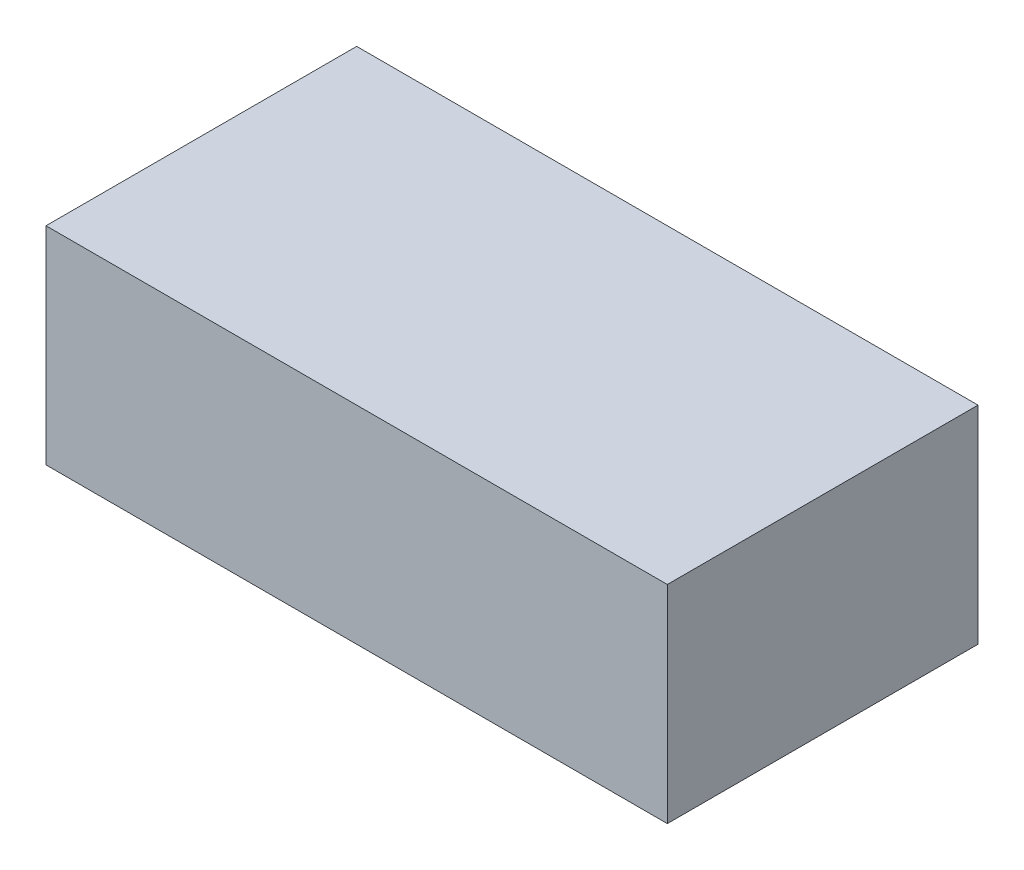
ISO-10303-21;
HEADER;
FILE_DESCRIPTION(('STEP AP214'),'2;1');
FILE_NAME('part.step','',(''),(''),'','','');
FILE_SCHEMA(('AUTOMOTIVE_DESIGN { 1 0 10303 214 1 1 1 1 }'));
ENDSEC;
DATA;
#1=APPLICATION_CONTEXT('core data for automotive mechanical design processes');
#2=APPLICATION_PROTOCOL_DEFINITION('international standard','automotive_design',2000,#1);
#3=PRODUCT_CONTEXT('',#1,'mechanical');
#4=PRODUCT('Part','Part','',(#3));
#5=PRODUCT_RELATED_PRODUCT_CATEGORY('part','',(#4));
#6=PRODUCT_DEFINITION_FORMATION('','',#4);
#7=PRODUCT_DEFINITION_CONTEXT('part definition',#1,'design');
#8=PRODUCT_DEFINITION('design','',#6,#7);
#9=PRODUCT_DEFINITION_SHAPE('','',#8);
#10=(LENGTH_UNIT() NAMED_UNIT(*) SI_UNIT(.MILLI.,.METRE.));
#11=(NAMED_UNIT(*) PLANE_ANGLE_UNIT() SI_UNIT($,.RADIAN.));
#12=(NAMED_UNIT(*) SI_UNIT($,.STERADIAN.) SOLID_ANGLE_UNIT());
#13=UNCERTAINTY_MEASURE_WITH_UNIT(LENGTH_MEASURE(1.E-05),#10,'distance_accuracy_value','');
#14=(GEOMETRIC_REPRESENTATION_CONTEXT(3) GLOBAL_UNCERTAINTY_ASSIGNED_CONTEXT((#13)) GLOBAL_UNIT_ASSIGNED_CONTEXT((#10,
#11,#12)) REPRESENTATION_CONTEXT('',''));
#15=CARTESIAN_POINT('',(0.,0.,0.));
#16=DIRECTION('',(0.,0.,1.));
#17=DIRECTION('',(1.,0.,0.));
#18=AXIS2_PLACEMENT_3D('',#15,#16,#17);
#19=CARTESIAN_POINT('',(30.,20.,15.));
#20=DIRECTION('',(-1.,0.,0.));
#21=DIRECTION('',(0.,0.,1.));
#22=AXIS2_PLACEMENT_3D('',#19,#20,#21);
#23=PLANE('',#22);
#24=DIRECTION('',(0.,0.,-1.));
#25=VECTOR('',#24,1.);
#26=CARTESIAN_POINT('',(30.,0.,15.));
#27=LINE('',#26,#25);
#28=CARTESIAN_POINT('',(30.,0.,15.));
#29=VERTEX_POINT('',#28);
#30=CARTESIAN_POINT('',(30.,0.,-15.0000000000001));
#31=VERTEX_POINT('',#30);
#32=EDGE_CURVE('E96',#29,#31,#27,.T.);
#33=ORIENTED_EDGE('',*,*,#32,.T.);
#34=DIRECTION('',(0.,-1.,0.));
#35=VECTOR('',#34,1.);
#36=CARTESIAN_POINT('',(30.,20.,-15.0000000000001));
#37=LINE('',#36,#35);
#38=CARTESIAN_POINT('',(30.,20.,-15.0000000000001));
#39=VERTEX_POINT('',#38);
#40=EDGE_CURVE('E11',#39,#31,#37,.T.);
#41=ORIENTED_EDGE('',*,*,#40,.F.);
#42=DIRECTION('',(0.,0.,-1.));
#43=VECTOR('',#42,1.);
#44=CARTESIAN_POINT('',(30.,20.,15.));
#45=LINE('',#44,#43);
#46=CARTESIAN_POINT('',(30.,20.,15.));
#47=VERTEX_POINT('',#46);
#48=EDGE_CURVE('E84',#47,#39,#45,.T.);
#49=ORIENTED_EDGE('',*,*,#48,.F.);
#50=DIRECTION('',(0.,-1.,0.));
#51=VECTOR('',#50,1.);
#52=CARTESIAN_POINT('',(30.,20.,15.));
#53=LINE('',#52,#51);
#54=EDGE_CURVE('E92',#47,#29,#53,.T.);
#55=ORIENTED_EDGE('',*,*,#54,.T.);
#56=EDGE_LOOP('',(#33,#41,#49,#55));
#57=FACE_BOUND('',#56,.T.);
#58=ADVANCED_FACE('F33',(#57),#23,.F.);
#59=CARTESIAN_POINT('',(-30.,20.,-15.0000000000001));
#60=DIRECTION('',(0.,0.,1.));
#61=DIRECTION('',(1.,0.,0.));
#62=AXIS2_PLACEMENT_3D('',#59,#60,#61);
#63=PLANE('',#62);
#64=DIRECTION('',(-1.,0.,0.));
#65=VECTOR('',#64,1.);
#66=CARTESIAN_POINT('',(-30.,0.,-15.0000000000001));
#67=LINE('',#66,#65);
#68=CARTESIAN_POINT('',(-30.,0.,-15.0000000000001));
#69=VERTEX_POINT('',#68);
#70=EDGE_CURVE('E88',#31,#69,#67,.T.);
#71=ORIENTED_EDGE('',*,*,#70,.T.);
#72=DIRECTION('',(0.,-1.,0.));
#73=VECTOR('',#72,1.);
#74=CARTESIAN_POINT('',(-30.,20.,-15.0000000000001));
#75=LINE('',#74,#73);
#76=CARTESIAN_POINT('',(-30.,20.,-15.0000000000001));
#77=VERTEX_POINT('',#76);
#78=EDGE_CURVE('E41',#77,#69,#75,.T.);
#79=ORIENTED_EDGE('',*,*,#78,.F.);
#80=DIRECTION('',(-1.,0.,0.));
#81=VECTOR('',#80,1.);
#82=CARTESIAN_POINT('',(-30.,20.,-15.0000000000001));
#83=LINE('',#82,#81);
#84=EDGE_CURVE('E79',#39,#77,#83,.T.);
#85=ORIENTED_EDGE('',*,*,#84,.F.);
#86=ORIENTED_EDGE('',*,*,#40,.T.);
#87=EDGE_LOOP('',(#71,#79,#85,#86));
#88=FACE_BOUND('',#87,.T.);
#89=ADVANCED_FACE('F87',(#88),#63,.F.);
#90=CARTESIAN_POINT('',(-30.,20.,15.));
#91=DIRECTION('',(1.,0.,0.));
#92=DIRECTION('',(0.,0.,-1.));
#93=AXIS2_PLACEMENT_3D('',#90,#91,#92);
#94=PLANE('',#93);
#95=DIRECTION('',(0.,0.,1.));
#96=VECTOR('',#95,1.);
#97=CARTESIAN_POINT('',(-30.,0.,15.));
#98=LINE('',#97,#96);
#99=CARTESIAN_POINT('',(-30.,0.,15.));
#100=VERTEX_POINT('',#99);
#101=EDGE_CURVE('E66',#69,#100,#98,.T.);
#102=ORIENTED_EDGE('',*,*,#101,.T.);
#103=DIRECTION('',(0.,-1.,0.));
#104=VECTOR('',#103,1.);
#105=CARTESIAN_POINT('',(-30.,20.,15.));
#106=LINE('',#105,#104);
#107=CARTESIAN_POINT('',(-30.,20.,15.));
#108=VERTEX_POINT('',#107);
#109=EDGE_CURVE('E89',#108,#100,#106,.T.);
#110=ORIENTED_EDGE('',*,*,#109,.F.);
#111=DIRECTION('',(0.,0.,1.));
#112=VECTOR('',#111,1.);
#113=CARTESIAN_POINT('',(-30.,20.,15.));
#114=LINE('',#113,#112);
#115=EDGE_CURVE('E82',#77,#108,#114,.T.);
#116=ORIENTED_EDGE('',*,*,#115,.F.);
#117=ORIENTED_EDGE('',*,*,#78,.T.);
#118=EDGE_LOOP('',(#102,#110,#116,#117));
#119=FACE_BOUND('',#118,.T.);
#120=ADVANCED_FACE('F90',(#119),#94,.F.);
#121=CARTESIAN_POINT('',(-30.,20.,15.));
#122=DIRECTION('',(0.,0.,-1.));
#123=DIRECTION('',(-1.,0.,0.));
#124=AXIS2_PLACEMENT_3D('',#121,#122,#123);
#125=PLANE('',#124);
#126=DIRECTION('',(1.,0.,0.));
#127=VECTOR('',#126,1.);
#128=CARTESIAN_POINT('',(-30.,0.,15.));
#129=LINE('',#128,#127);
#130=EDGE_CURVE('E72',#100,#29,#129,.T.);
#131=ORIENTED_EDGE('',*,*,#130,.T.);
#132=ORIENTED_EDGE('',*,*,#54,.F.);
#133=DIRECTION('',(1.,0.,0.));
#134=VECTOR('',#133,1.);
#135=CARTESIAN_POINT('',(-30.,20.,15.));
#136=LINE('',#135,#134);
#137=EDGE_CURVE('E49',#108,#47,#136,.T.);
#138=ORIENTED_EDGE('',*,*,#137,.F.);
#139=ORIENTED_EDGE('',*,*,#109,.T.);
#140=EDGE_LOOP('',(#131,#132,#138,#139));
#141=FACE_BOUND('',#140,.T.);
#142=ADVANCED_FACE('F103',(#141),#125,.F.);
#143=CARTESIAN_POINT('',(0.,20.,0.));
#144=DIRECTION('',(0.,-1.,0.));
#145=DIRECTION('',(0.,0.,-1.));
#146=AXIS2_PLACEMENT_3D('',#143,#144,#145);
#147=PLANE('',#146);
#148=ORIENTED_EDGE('',*,*,#48,.T.);
#149=ORIENTED_EDGE('',*,*,#84,.T.);
#150=ORIENTED_EDGE('',*,*,#115,.T.);
#151=ORIENTED_EDGE('',*,*,#137,.T.);
#152=EDGE_LOOP('',(#148,#149,#150,#151));
#153=FACE_BOUND('',#152,.T.);
#154=ADVANCED_FACE('F80',(#153),#147,.F.);
#155=CARTESIAN_POINT('',(0.,0.,0.));
#156=DIRECTION('',(0.,-1.,0.));
#157=DIRECTION('',(0.,0.,-1.));
#158=AXIS2_PLACEMENT_3D('',#155,#156,#157);
#159=PLANE('',#158);
#160=ORIENTED_EDGE('',*,*,#32,.F.);
#161=ORIENTED_EDGE('',*,*,#130,.F.);
#162=ORIENTED_EDGE('',*,*,#101,.F.);
#163=ORIENTED_EDGE('',*,*,#70,.F.);
#164=EDGE_LOOP('',(#160,#161,#162,#163));
#165=FACE_BOUND('',#164,.T.);
#166=ADVANCED_FACE('F106',(#165),#159,.T.);
#167=CLOSED_SHELL('',(#58,#89,#120,#142,#154,#166));
#168=MANIFOLD_SOLID_BREP('B2',#167);
#169=ADVANCED_BREP_SHAPE_REPRESENTATION('',(#18,#168),#14);
#170=SHAPE_DEFINITION_REPRESENTATION(#9,#169);
ENDSEC;
END-ISO-10303-21;
